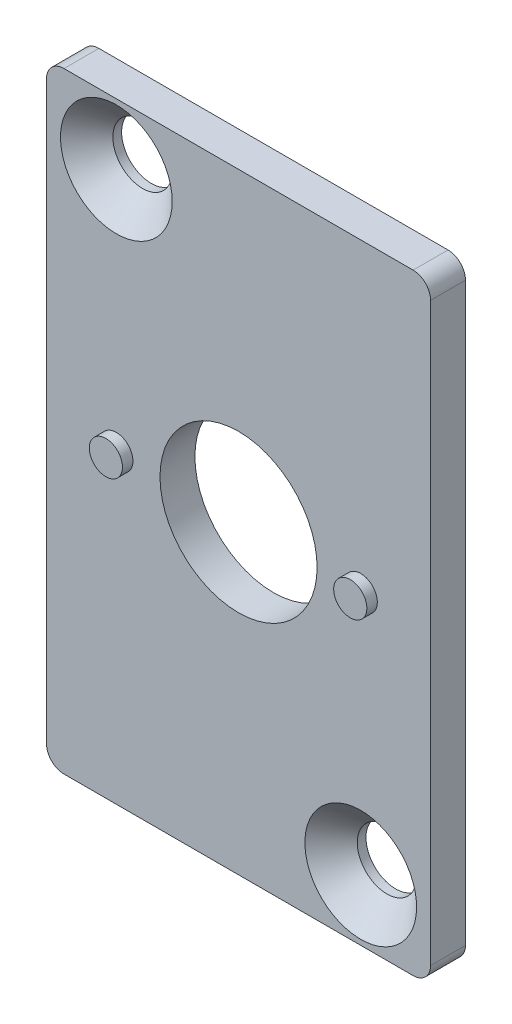
ISO-10303-21;
HEADER;
FILE_DESCRIPTION(('STEP AP214'),'2;1');
FILE_NAME('part.step','',(''),(''),'','','');
FILE_SCHEMA(('AUTOMOTIVE_DESIGN { 1 0 10303 214 1 1 1 1 }'));
ENDSEC;
DATA;
#1=APPLICATION_CONTEXT('core data for automotive mechanical design processes');
#2=APPLICATION_PROTOCOL_DEFINITION('international standard','automotive_design',2000,#1);
#3=PRODUCT_CONTEXT('',#1,'mechanical');
#4=PRODUCT('Part','Part','',(#3));
#5=PRODUCT_RELATED_PRODUCT_CATEGORY('part','',(#4));
#6=PRODUCT_DEFINITION_FORMATION('','',#4);
#7=PRODUCT_DEFINITION_CONTEXT('part definition',#1,'design');
#8=PRODUCT_DEFINITION('design','',#6,#7);
#9=PRODUCT_DEFINITION_SHAPE('','',#8);
#10=(LENGTH_UNIT() NAMED_UNIT(*) SI_UNIT(.MILLI.,.METRE.));
#11=(NAMED_UNIT(*) PLANE_ANGLE_UNIT() SI_UNIT($,.RADIAN.));
#12=(NAMED_UNIT(*) SI_UNIT($,.STERADIAN.) SOLID_ANGLE_UNIT());
#13=UNCERTAINTY_MEASURE_WITH_UNIT(LENGTH_MEASURE(1.E-05),#10,'distance_accuracy_value','');
#14=(GEOMETRIC_REPRESENTATION_CONTEXT(3) GLOBAL_UNCERTAINTY_ASSIGNED_CONTEXT((#13)) GLOBAL_UNIT_ASSIGNED_CONTEXT((#10,
#11,#12)) REPRESENTATION_CONTEXT('',''));
#15=CARTESIAN_POINT('',(0.,0.,0.));
#16=DIRECTION('',(0.,0.,1.));
#17=DIRECTION('',(1.,0.,0.));
#18=AXIS2_PLACEMENT_3D('',#15,#16,#17);
#19=CARTESIAN_POINT('',(-12.8609204169845,0.950419527078566,68.6));
#20=DIRECTION('',(0.,0.,1.));
#21=DIRECTION('',(1.,0.,0.));
#22=AXIS2_PLACEMENT_3D('',#19,#20,#21);
#23=PLANE('',#22);
#24=CARTESIAN_POINT('',(-12.8609204169845,0.950419527078566,68.6));
#25=DIRECTION('',(0.,0.,1.));
#26=DIRECTION('',(1.,0.,0.));
#27=AXIS2_PLACEMENT_3D('',#24,#25,#26);
#28=CIRCLE('',#27,0.95);
#29=CARTESIAN_POINT('',(-11.9109204169845,0.950419527078566,68.6));
#30=VERTEX_POINT('',#29);
#31=EDGE_CURVE('E21',#30,#30,#28,.F.);
#32=ORIENTED_EDGE('',*,*,#31,.F.);
#33=EDGE_LOOP('',(#32));
#34=FACE_BOUND('',#33,.T.);
#35=ADVANCED_FACE('F18',(#34),#23,.T.);
#36=CARTESIAN_POINT('',(1.13907958301551,0.950419527078566,68.6));
#37=DIRECTION('',(0.,0.,1.));
#38=DIRECTION('',(1.,0.,0.));
#39=AXIS2_PLACEMENT_3D('',#36,#37,#38);
#40=PLANE('',#39);
#41=CARTESIAN_POINT('',(1.13907958301551,0.950419527078566,68.6));
#42=DIRECTION('',(0.,0.,1.));
#43=DIRECTION('',(1.,0.,0.));
#44=AXIS2_PLACEMENT_3D('',#41,#42,#43);
#45=CIRCLE('',#44,0.95);
#46=CARTESIAN_POINT('',(2.08907958301551,0.950419527078566,68.6));
#47=VERTEX_POINT('',#46);
#48=EDGE_CURVE('E71',#47,#47,#45,.F.);
#49=ORIENTED_EDGE('',*,*,#48,.F.);
#50=EDGE_LOOP('',(#49));
#51=FACE_BOUND('',#50,.T.);
#52=ADVANCED_FACE('F172',(#51),#40,.T.);
#53=CARTESIAN_POINT('',(-12.8609204169845,0.950419527078566,68.6));
#54=DIRECTION('',(0.,0.,1.));
#55=DIRECTION('',(1.,0.,0.));
#56=AXIS2_PLACEMENT_3D('',#53,#54,#55);
#57=CYLINDRICAL_SURFACE('',#56,0.95);
#58=CARTESIAN_POINT('',(-12.8609204169845,0.950419527078566,68.));
#59=DIRECTION('',(0.,0.,1.));
#60=DIRECTION('',(1.,0.,0.));
#61=AXIS2_PLACEMENT_3D('',#58,#59,#60);
#62=CIRCLE('',#61,0.95);
#63=CARTESIAN_POINT('',(-11.9109204169845,0.950419527078566,68.));
#64=VERTEX_POINT('',#63);
#65=EDGE_CURVE('E145',#64,#64,#62,.F.);
#66=ORIENTED_EDGE('',*,*,#65,.F.);
#67=EDGE_LOOP('',(#66));
#68=FACE_BOUND('',#67,.T.);
#69=ORIENTED_EDGE('',*,*,#31,.T.);
#70=EDGE_LOOP('',(#69));
#71=FACE_BOUND('',#70,.T.);
#72=ADVANCED_FACE('F169',(#68,#71),#57,.T.);
#73=CARTESIAN_POINT('',(1.13907958301551,0.950419527078566,68.6));
#74=DIRECTION('',(0.,0.,1.));
#75=DIRECTION('',(1.,0.,0.));
#76=AXIS2_PLACEMENT_3D('',#73,#74,#75);
#77=CYLINDRICAL_SURFACE('',#76,0.95);
#78=CARTESIAN_POINT('',(1.13907958301551,0.950419527078566,68.));
#79=DIRECTION('',(0.,0.,1.));
#80=DIRECTION('',(1.,0.,0.));
#81=AXIS2_PLACEMENT_3D('',#78,#79,#80);
#82=CIRCLE('',#81,0.95);
#83=CARTESIAN_POINT('',(2.08907958301551,0.950419527078566,68.));
#84=VERTEX_POINT('',#83);
#85=EDGE_CURVE('E142',#84,#84,#82,.F.);
#86=ORIENTED_EDGE('',*,*,#85,.F.);
#87=EDGE_LOOP('',(#86));
#88=FACE_BOUND('',#87,.T.);
#89=ORIENTED_EDGE('',*,*,#48,.T.);
#90=EDGE_LOOP('',(#89));
#91=FACE_BOUND('',#90,.T.);
#92=ADVANCED_FACE('F237',(#88,#91),#77,.T.);
#93=CARTESIAN_POINT('',(4.13907958301551,17.4504195270786,68.));
#94=DIRECTION('',(0.,0.,1.));
#95=DIRECTION('',(1.,0.,0.));
#96=AXIS2_PLACEMENT_3D('',#93,#94,#95);
#97=CYLINDRICAL_SURFACE('',#96,1.);
#98=CARTESIAN_POINT('',(4.13907958301551,17.4504195270786,68.));
#99=DIRECTION('',(0.,0.,1.));
#100=DIRECTION('',(1.,0.,0.));
#101=AXIS2_PLACEMENT_3D('',#98,#99,#100);
#102=CIRCLE('',#101,1.);
#103=CARTESIAN_POINT('',(5.13907958301551,17.4504195270786,68.));
#104=VERTEX_POINT('',#103);
#105=CARTESIAN_POINT('',(4.13907958301551,18.4504195270786,68.));
#106=VERTEX_POINT('',#105);
#107=EDGE_CURVE('E151',#104,#106,#102,.T.);
#108=ORIENTED_EDGE('',*,*,#107,.F.);
#109=DIRECTION('',(0.,0.,-1.));
#110=VECTOR('',#109,1.);
#111=CARTESIAN_POINT('',(5.13907958301551,17.4504195270786,68.));
#112=LINE('',#111,#110);
#113=CARTESIAN_POINT('',(5.13907958301551,17.4504195270786,66.));
#114=VERTEX_POINT('',#113);
#115=EDGE_CURVE('E68',#114,#104,#112,.F.);
#116=ORIENTED_EDGE('',*,*,#115,.F.);
#117=CARTESIAN_POINT('',(4.13907958301551,17.4504195270786,66.));
#118=DIRECTION('',(0.,0.,1.));
#119=DIRECTION('',(1.,0.,0.));
#120=AXIS2_PLACEMENT_3D('',#117,#118,#119);
#121=CIRCLE('',#120,1.);
#122=CARTESIAN_POINT('',(4.13907958301551,18.4504195270786,66.));
#123=VERTEX_POINT('',#122);
#124=EDGE_CURVE('E58',#114,#123,#121,.T.);
#125=ORIENTED_EDGE('',*,*,#124,.T.);
#126=DIRECTION('',(0.,0.,1.));
#127=VECTOR('',#126,1.);
#128=CARTESIAN_POINT('',(4.13907958301551,18.4504195270786,68.));
#129=LINE('',#128,#127);
#130=EDGE_CURVE('E66',#106,#123,#129,.F.);
#131=ORIENTED_EDGE('',*,*,#130,.F.);
#132=EDGE_LOOP('',(#108,#116,#125,#131));
#133=FACE_BOUND('',#132,.T.);
#134=ADVANCED_FACE('F64',(#133),#97,.T.);
#135=CARTESIAN_POINT('',(-15.8609204169845,17.4504195270786,68.));
#136=DIRECTION('',(0.,0.,1.));
#137=DIRECTION('',(1.,0.,0.));
#138=AXIS2_PLACEMENT_3D('',#135,#136,#137);
#139=CYLINDRICAL_SURFACE('',#138,1.);
#140=CARTESIAN_POINT('',(-15.8609204169845,17.4504195270786,68.));
#141=DIRECTION('',(0.,0.,1.));
#142=DIRECTION('',(1.,0.,0.));
#143=AXIS2_PLACEMENT_3D('',#140,#141,#142);
#144=CIRCLE('',#143,1.);
#145=CARTESIAN_POINT('',(-15.8609204169845,18.4504195270786,68.));
#146=VERTEX_POINT('',#145);
#147=CARTESIAN_POINT('',(-16.8609204169845,17.4504195270786,68.));
#148=VERTEX_POINT('',#147);
#149=EDGE_CURVE('E148',#146,#148,#144,.T.);
#150=ORIENTED_EDGE('',*,*,#149,.F.);
#151=DIRECTION('',(0.,0.,1.));
#152=VECTOR('',#151,1.);
#153=CARTESIAN_POINT('',(-15.8609204169845,18.4504195270786,68.));
#154=LINE('',#153,#152);
#155=CARTESIAN_POINT('',(-15.8609204169845,18.4504195270786,66.));
#156=VERTEX_POINT('',#155);
#157=EDGE_CURVE('E110',#156,#146,#154,.T.);
#158=ORIENTED_EDGE('',*,*,#157,.F.);
#159=CARTESIAN_POINT('',(-15.8609204169845,17.4504195270786,66.));
#160=DIRECTION('',(0.,0.,1.));
#161=DIRECTION('',(1.,0.,0.));
#162=AXIS2_PLACEMENT_3D('',#159,#160,#161);
#163=CIRCLE('',#162,1.);
#164=CARTESIAN_POINT('',(-16.8609204169845,17.4504195270786,66.));
#165=VERTEX_POINT('',#164);
#166=EDGE_CURVE('E70',#156,#165,#163,.T.);
#167=ORIENTED_EDGE('',*,*,#166,.T.);
#168=DIRECTION('',(0.,0.,1.));
#169=VECTOR('',#168,1.);
#170=CARTESIAN_POINT('',(-16.8609204169845,17.4504195270786,68.));
#171=LINE('',#170,#169);
#172=EDGE_CURVE('E104',#148,#165,#171,.F.);
#173=ORIENTED_EDGE('',*,*,#172,.F.);
#174=EDGE_LOOP('',(#150,#158,#167,#173));
#175=FACE_BOUND('',#174,.T.);
#176=ADVANCED_FACE('F230',(#175),#139,.T.);
#177=CARTESIAN_POINT('',(-15.8609204169845,-15.5495804729214,68.));
#178=DIRECTION('',(0.,0.,1.));
#179=DIRECTION('',(1.,0.,0.));
#180=AXIS2_PLACEMENT_3D('',#177,#178,#179);
#181=CYLINDRICAL_SURFACE('',#180,1.);
#182=CARTESIAN_POINT('',(-15.8609204169845,-15.5495804729214,68.));
#183=DIRECTION('',(0.,0.,1.));
#184=DIRECTION('',(1.,0.,0.));
#185=AXIS2_PLACEMENT_3D('',#182,#183,#184);
#186=CIRCLE('',#185,1.);
#187=CARTESIAN_POINT('',(-16.8609204169845,-15.5495804729214,68.));
#188=VERTEX_POINT('',#187);
#189=CARTESIAN_POINT('',(-15.8609204169845,-16.5495804729214,68.));
#190=VERTEX_POINT('',#189);
#191=EDGE_CURVE('E157',#188,#190,#186,.T.);
#192=ORIENTED_EDGE('',*,*,#191,.F.);
#193=DIRECTION('',(0.,0.,1.));
#194=VECTOR('',#193,1.);
#195=CARTESIAN_POINT('',(-16.8609204169845,-15.5495804729214,68.));
#196=LINE('',#195,#194);
#197=CARTESIAN_POINT('',(-16.8609204169845,-15.5495804729214,66.));
#198=VERTEX_POINT('',#197);
#199=EDGE_CURVE('E107',#198,#188,#196,.T.);
#200=ORIENTED_EDGE('',*,*,#199,.F.);
#201=CARTESIAN_POINT('',(-15.8609204169845,-15.5495804729214,66.));
#202=DIRECTION('',(0.,0.,1.));
#203=DIRECTION('',(1.,0.,0.));
#204=AXIS2_PLACEMENT_3D('',#201,#202,#203);
#205=CIRCLE('',#204,1.);
#206=CARTESIAN_POINT('',(-15.8609204169845,-16.5495804729214,66.));
#207=VERTEX_POINT('',#206);
#208=EDGE_CURVE('E161',#198,#207,#205,.T.);
#209=ORIENTED_EDGE('',*,*,#208,.T.);
#210=DIRECTION('',(0.,0.,1.));
#211=VECTOR('',#210,1.);
#212=CARTESIAN_POINT('',(-15.8609204169845,-16.5495804729214,68.));
#213=LINE('',#212,#211);
#214=EDGE_CURVE('E96',#190,#207,#213,.F.);
#215=ORIENTED_EDGE('',*,*,#214,.F.);
#216=EDGE_LOOP('',(#192,#200,#209,#215));
#217=FACE_BOUND('',#216,.T.);
#218=ADVANCED_FACE('F226',(#217),#181,.T.);
#219=CARTESIAN_POINT('',(4.13907958301551,-15.5495804729214,68.));
#220=DIRECTION('',(0.,0.,1.));
#221=DIRECTION('',(1.,0.,0.));
#222=AXIS2_PLACEMENT_3D('',#219,#220,#221);
#223=CYLINDRICAL_SURFACE('',#222,1.);
#224=CARTESIAN_POINT('',(4.13907958301551,-15.5495804729214,68.));
#225=DIRECTION('',(0.,0.,1.));
#226=DIRECTION('',(1.,0.,0.));
#227=AXIS2_PLACEMENT_3D('',#224,#225,#226);
#228=CIRCLE('',#227,1.);
#229=CARTESIAN_POINT('',(4.13907958301551,-16.5495804729214,68.));
#230=VERTEX_POINT('',#229);
#231=CARTESIAN_POINT('',(5.13907958301551,-15.5495804729214,68.));
#232=VERTEX_POINT('',#231);
#233=EDGE_CURVE('E154',#230,#232,#228,.T.);
#234=ORIENTED_EDGE('',*,*,#233,.F.);
#235=DIRECTION('',(0.,0.,1.));
#236=VECTOR('',#235,1.);
#237=CARTESIAN_POINT('',(4.13907958301551,-16.5495804729214,68.));
#238=LINE('',#237,#236);
#239=CARTESIAN_POINT('',(4.13907958301551,-16.5495804729214,66.));
#240=VERTEX_POINT('',#239);
#241=EDGE_CURVE('E99',#240,#230,#238,.T.);
#242=ORIENTED_EDGE('',*,*,#241,.F.);
#243=CARTESIAN_POINT('',(4.13907958301551,-15.5495804729214,66.));
#244=DIRECTION('',(0.,0.,1.));
#245=DIRECTION('',(1.,0.,0.));
#246=AXIS2_PLACEMENT_3D('',#243,#244,#245);
#247=CIRCLE('',#246,1.);
#248=CARTESIAN_POINT('',(5.13907958301551,-15.5495804729214,66.));
#249=VERTEX_POINT('',#248);
#250=EDGE_CURVE('E36',#240,#249,#247,.T.);
#251=ORIENTED_EDGE('',*,*,#250,.T.);
#252=DIRECTION('',(0.,0.,-1.));
#253=VECTOR('',#252,1.);
#254=CARTESIAN_POINT('',(5.13907958301551,-15.5495804729214,68.));
#255=LINE('',#254,#253);
#256=EDGE_CURVE('E112',#232,#249,#255,.T.);
#257=ORIENTED_EDGE('',*,*,#256,.F.);
#258=EDGE_LOOP('',(#234,#242,#251,#257));
#259=FACE_BOUND('',#258,.T.);
#260=ADVANCED_FACE('F222',(#259),#223,.T.);
#261=CARTESIAN_POINT('',(-5.86092041698449,0.950419527078566,68.));
#262=DIRECTION('',(0.,0.,1.));
#263=DIRECTION('',(1.,0.,0.));
#264=AXIS2_PLACEMENT_3D('',#261,#262,#263);
#265=PLANE('',#264);
#266=ORIENTED_EDGE('',*,*,#85,.T.);
#267=EDGE_LOOP('',(#266));
#268=FACE_BOUND('',#267,.T.);
#269=CARTESIAN_POINT('',(-12.8609204169845,14.9504195270786,68.0000000000405));
#270=DIRECTION('',(0.,0.,1.));
#271=DIRECTION('',(1.,0.,0.));
#272=AXIS2_PLACEMENT_3D('',#269,#270,#271);
#273=CIRCLE('',#272,3.19999999999364);
#274=CARTESIAN_POINT('',(-9.66092041699085,14.9504195270786,68.0000000000405));
#275=VERTEX_POINT('',#274);
#276=EDGE_CURVE('E117',#275,#275,#273,.F.);
#277=ORIENTED_EDGE('',*,*,#276,.T.);
#278=EDGE_LOOP('',(#277));
#279=FACE_BOUND('',#278,.T.);
#280=CARTESIAN_POINT('',(1.13907958301552,-13.0495804729214,67.9999999999836));
#281=DIRECTION('',(0.,0.,1.));
#282=DIRECTION('',(1.,0.,0.));
#283=AXIS2_PLACEMENT_3D('',#280,#281,#282);
#284=CIRCLE('',#283,3.20000000000364);
#285=CARTESIAN_POINT('',(4.33907958301916,-13.0495804729214,67.9999999999836));
#286=VERTEX_POINT('',#285);
#287=EDGE_CURVE('E139',#286,#286,#284,.F.);
#288=ORIENTED_EDGE('',*,*,#287,.T.);
#289=EDGE_LOOP('',(#288));
#290=FACE_BOUND('',#289,.T.);
#291=CARTESIAN_POINT('',(-5.86092041698449,0.950419527078566,68.));
#292=DIRECTION('',(0.,0.,1.));
#293=DIRECTION('',(1.,0.,0.));
#294=AXIS2_PLACEMENT_3D('',#291,#292,#293);
#295=CIRCLE('',#294,4.5);
#296=CARTESIAN_POINT('',(-1.36092041698449,0.950419527078566,68.));
#297=VERTEX_POINT('',#296);
#298=EDGE_CURVE('E103',#297,#297,#295,.F.);
#299=ORIENTED_EDGE('',*,*,#298,.T.);
#300=EDGE_LOOP('',(#299));
#301=FACE_BOUND('',#300,.T.);
#302=ORIENTED_EDGE('',*,*,#65,.T.);
#303=EDGE_LOOP('',(#302));
#304=FACE_BOUND('',#303,.T.);
#305=DIRECTION('',(1.,0.,0.));
#306=VECTOR('',#305,1.);
#307=CARTESIAN_POINT('',(5.13907958301551,18.4504195270786,68.));
#308=LINE('',#307,#306);
#309=EDGE_CURVE('E80',#146,#106,#308,.T.);
#310=ORIENTED_EDGE('',*,*,#309,.F.);
#311=ORIENTED_EDGE('',*,*,#149,.T.);
#312=DIRECTION('',(0.,-1.,0.));
#313=VECTOR('',#312,1.);
#314=CARTESIAN_POINT('',(-16.8609204169845,18.4504195270786,68.));
#315=LINE('',#314,#313);
#316=EDGE_CURVE('E81',#188,#148,#315,.F.);
#317=ORIENTED_EDGE('',*,*,#316,.F.);
#318=ORIENTED_EDGE('',*,*,#191,.T.);
#319=DIRECTION('',(1.,0.,0.));
#320=VECTOR('',#319,1.);
#321=CARTESIAN_POINT('',(-16.8609204169845,-16.5495804729214,68.));
#322=LINE('',#321,#320);
#323=EDGE_CURVE('E100',#230,#190,#322,.F.);
#324=ORIENTED_EDGE('',*,*,#323,.F.);
#325=ORIENTED_EDGE('',*,*,#233,.T.);
#326=DIRECTION('',(0.,1.,0.));
#327=VECTOR('',#326,1.);
#328=CARTESIAN_POINT('',(5.13907958301551,-16.5495804729214,68.));
#329=LINE('',#328,#327);
#330=EDGE_CURVE('E115',#104,#232,#329,.F.);
#331=ORIENTED_EDGE('',*,*,#330,.F.);
#332=ORIENTED_EDGE('',*,*,#107,.T.);
#333=EDGE_LOOP('',(#310,#311,#317,#318,#324,#325,#331,#332));
#334=FACE_BOUND('',#333,.T.);
#335=ADVANCED_FACE('F218',(#268,#279,#290,#301,#304,#334),#265,.T.);
#336=CARTESIAN_POINT('',(1.13907958301552,-13.0495804729214,67.9999999998699));
#337=DIRECTION('',(0.,0.,1.));
#338=DIRECTION('',(1.,0.,0.));
#339=AXIS2_PLACEMENT_3D('',#336,#337,#338);
#340=CONICAL_SURFACE('',#339,3.19999999988995,0.785398163397448);
#341=ORIENTED_EDGE('',*,*,#287,.F.);
#342=EDGE_LOOP('',(#341));
#343=FACE_BOUND('',#342,.T.);
#344=CARTESIAN_POINT('',(1.13907958301552,-13.0495804729214,66.5));
#345=DIRECTION('',(0.,0.,-1.));
#346=DIRECTION('',(-1.,0.,0.));
#347=AXIS2_PLACEMENT_3D('',#344,#345,#346);
#348=CIRCLE('',#347,1.69999999999999);
#349=CARTESIAN_POINT('',(-0.560920416984477,-13.0495804729214,66.5));
#350=VERTEX_POINT('',#349);
#351=EDGE_CURVE('E120',#350,#350,#348,.T.);
#352=ORIENTED_EDGE('',*,*,#351,.T.);
#353=EDGE_LOOP('',(#352));
#354=FACE_BOUND('',#353,.T.);
#355=ADVANCED_FACE('F214',(#343,#354),#340,.F.);
#356=CARTESIAN_POINT('',(-12.8609204169845,14.9504195270786,67.9999999999268));
#357=DIRECTION('',(0.,0.,1.));
#358=DIRECTION('',(1.,0.,0.));
#359=AXIS2_PLACEMENT_3D('',#356,#357,#358);
#360=CONICAL_SURFACE('',#359,3.19999999987996,0.785398163378501);
#361=ORIENTED_EDGE('',*,*,#276,.F.);
#362=EDGE_LOOP('',(#361));
#363=FACE_BOUND('',#362,.T.);
#364=CARTESIAN_POINT('',(-12.8609204169845,14.9504195270786,66.5));
#365=DIRECTION('',(0.,0.,-1.));
#366=DIRECTION('',(-1.,0.,0.));
#367=AXIS2_PLACEMENT_3D('',#364,#365,#366);
#368=CIRCLE('',#367,1.69999999999999);
#369=CARTESIAN_POINT('',(-14.5609204169845,14.9504195270786,66.5));
#370=VERTEX_POINT('',#369);
#371=EDGE_CURVE('E92',#370,#370,#368,.T.);
#372=ORIENTED_EDGE('',*,*,#371,.T.);
#373=EDGE_LOOP('',(#372));
#374=FACE_BOUND('',#373,.T.);
#375=ADVANCED_FACE('F210',(#363,#374),#360,.F.);
#376=CARTESIAN_POINT('',(5.13907958301551,-16.5495804729214,68.));
#377=DIRECTION('',(1.,0.,0.));
#378=DIRECTION('',(0.,0.,-1.));
#379=AXIS2_PLACEMENT_3D('',#376,#377,#378);
#380=PLANE('',#379);
#381=ORIENTED_EDGE('',*,*,#330,.T.);
#382=ORIENTED_EDGE('',*,*,#256,.T.);
#383=DIRECTION('',(0.,1.,0.));
#384=VECTOR('',#383,1.);
#385=CARTESIAN_POINT('',(5.13907958301551,0.950419527078566,66.));
#386=LINE('',#385,#384);
#387=EDGE_CURVE('E87',#249,#114,#386,.T.);
#388=ORIENTED_EDGE('',*,*,#387,.T.);
#389=ORIENTED_EDGE('',*,*,#115,.T.);
#390=EDGE_LOOP('',(#381,#382,#388,#389));
#391=FACE_BOUND('',#390,.T.);
#392=ADVANCED_FACE('F207',(#391),#380,.T.);
#393=CARTESIAN_POINT('',(5.13907958301551,18.4504195270786,68.));
#394=DIRECTION('',(0.,1.,0.));
#395=DIRECTION('',(0.,0.,1.));
#396=AXIS2_PLACEMENT_3D('',#393,#394,#395);
#397=PLANE('',#396);
#398=ORIENTED_EDGE('',*,*,#309,.T.);
#399=ORIENTED_EDGE('',*,*,#130,.T.);
#400=DIRECTION('',(1.,0.,0.));
#401=VECTOR('',#400,1.);
#402=CARTESIAN_POINT('',(-5.86092041698449,18.4504195270786,66.));
#403=LINE('',#402,#401);
#404=EDGE_CURVE('E78',#123,#156,#403,.F.);
#405=ORIENTED_EDGE('',*,*,#404,.T.);
#406=ORIENTED_EDGE('',*,*,#157,.T.);
#407=EDGE_LOOP('',(#398,#399,#405,#406));
#408=FACE_BOUND('',#407,.T.);
#409=ADVANCED_FACE('F76',(#408),#397,.T.);
#410=CARTESIAN_POINT('',(-16.8609204169845,18.4504195270786,68.));
#411=DIRECTION('',(-1.,0.,0.));
#412=DIRECTION('',(0.,-1.,0.));
#413=AXIS2_PLACEMENT_3D('',#410,#411,#412);
#414=PLANE('',#413);
#415=DIRECTION('',(0.,1.,0.));
#416=VECTOR('',#415,1.);
#417=CARTESIAN_POINT('',(-16.8609204169845,0.950419527078566,66.));
#418=LINE('',#417,#416);
#419=EDGE_CURVE('E86',#165,#198,#418,.F.);
#420=ORIENTED_EDGE('',*,*,#419,.T.);
#421=ORIENTED_EDGE('',*,*,#199,.T.);
#422=ORIENTED_EDGE('',*,*,#316,.T.);
#423=ORIENTED_EDGE('',*,*,#172,.T.);
#424=EDGE_LOOP('',(#420,#421,#422,#423));
#425=FACE_BOUND('',#424,.T.);
#426=ADVANCED_FACE('F200',(#425),#414,.T.);
#427=CARTESIAN_POINT('',(-16.8609204169845,-16.5495804729214,68.));
#428=DIRECTION('',(0.,-1.,0.));
#429=DIRECTION('',(1.,0.,0.));
#430=AXIS2_PLACEMENT_3D('',#427,#428,#429);
#431=PLANE('',#430);
#432=DIRECTION('',(1.,0.,0.));
#433=VECTOR('',#432,1.);
#434=CARTESIAN_POINT('',(-5.86092041698449,-16.5495804729214,66.));
#435=LINE('',#434,#433);
#436=EDGE_CURVE('E90',#207,#240,#435,.T.);
#437=ORIENTED_EDGE('',*,*,#436,.T.);
#438=ORIENTED_EDGE('',*,*,#241,.T.);
#439=ORIENTED_EDGE('',*,*,#323,.T.);
#440=ORIENTED_EDGE('',*,*,#214,.T.);
#441=EDGE_LOOP('',(#437,#438,#439,#440));
#442=FACE_BOUND('',#441,.T.);
#443=ADVANCED_FACE('F196',(#442),#431,.T.);
#444=CARTESIAN_POINT('',(-5.86092041698449,0.950419527078566,68.));
#445=DIRECTION('',(0.,0.,1.));
#446=DIRECTION('',(1.,0.,0.));
#447=AXIS2_PLACEMENT_3D('',#444,#445,#446);
#448=CYLINDRICAL_SURFACE('',#447,4.5);
#449=CARTESIAN_POINT('',(-5.86092041698449,0.950419527078566,66.));
#450=DIRECTION('',(0.,0.,1.));
#451=DIRECTION('',(1.,0.,0.));
#452=AXIS2_PLACEMENT_3D('',#449,#450,#451);
#453=CIRCLE('',#452,4.5);
#454=CARTESIAN_POINT('',(-1.36092041698449,0.950419527078566,66.));
#455=VERTEX_POINT('',#454);
#456=EDGE_CURVE('E132',#455,#455,#453,.F.);
#457=ORIENTED_EDGE('',*,*,#456,.T.);
#458=EDGE_LOOP('',(#457));
#459=FACE_BOUND('',#458,.T.);
#460=ORIENTED_EDGE('',*,*,#298,.F.);
#461=EDGE_LOOP('',(#460));
#462=FACE_BOUND('',#461,.T.);
#463=ADVANCED_FACE('F192',(#459,#462),#448,.F.);
#464=CARTESIAN_POINT('',(1.13907958301552,-13.0495804729214,68.));
#465=DIRECTION('',(0.,0.,-1.));
#466=DIRECTION('',(-1.,0.,0.));
#467=AXIS2_PLACEMENT_3D('',#464,#465,#466);
#468=CYLINDRICAL_SURFACE('',#467,1.69999999999999);
#469=ORIENTED_EDGE('',*,*,#351,.F.);
#470=EDGE_LOOP('',(#469));
#471=FACE_BOUND('',#470,.T.);
#472=CARTESIAN_POINT('',(1.13907958301552,-13.0495804729214,66.));
#473=DIRECTION('',(0.,0.,-1.));
#474=DIRECTION('',(-1.,0.,0.));
#475=AXIS2_PLACEMENT_3D('',#472,#473,#474);
#476=CIRCLE('',#475,1.69999999999999);
#477=CARTESIAN_POINT('',(-0.560920416984477,-13.0495804729214,66.));
#478=VERTEX_POINT('',#477);
#479=EDGE_CURVE('E27',#478,#478,#476,.T.);
#480=ORIENTED_EDGE('',*,*,#479,.T.);
#481=EDGE_LOOP('',(#480));
#482=FACE_BOUND('',#481,.T.);
#483=ADVANCED_FACE('F184',(#471,#482),#468,.F.);
#484=CARTESIAN_POINT('',(-12.8609204169845,14.9504195270786,68.));
#485=DIRECTION('',(0.,0.,-1.));
#486=DIRECTION('',(-1.,0.,0.));
#487=AXIS2_PLACEMENT_3D('',#484,#485,#486);
#488=CYLINDRICAL_SURFACE('',#487,1.69999999999999);
#489=ORIENTED_EDGE('',*,*,#371,.F.);
#490=EDGE_LOOP('',(#489));
#491=FACE_BOUND('',#490,.T.);
#492=CARTESIAN_POINT('',(-12.8609204169845,14.9504195270786,66.));
#493=DIRECTION('',(0.,0.,-1.));
#494=DIRECTION('',(-1.,0.,0.));
#495=AXIS2_PLACEMENT_3D('',#492,#493,#494);
#496=CIRCLE('',#495,1.69999999999999);
#497=CARTESIAN_POINT('',(-14.5609204169845,14.9504195270786,66.));
#498=VERTEX_POINT('',#497);
#499=EDGE_CURVE('E11',#498,#498,#496,.T.);
#500=ORIENTED_EDGE('',*,*,#499,.T.);
#501=EDGE_LOOP('',(#500));
#502=FACE_BOUND('',#501,.T.);
#503=ADVANCED_FACE('F179',(#491,#502),#488,.F.);
#504=CARTESIAN_POINT('',(-5.86092041698449,0.950419527078566,66.));
#505=DIRECTION('',(0.,0.,1.));
#506=DIRECTION('',(1.,0.,0.));
#507=AXIS2_PLACEMENT_3D('',#504,#505,#506);
#508=PLANE('',#507);
#509=ORIENTED_EDGE('',*,*,#499,.F.);
#510=EDGE_LOOP('',(#509));
#511=FACE_BOUND('',#510,.T.);
#512=ORIENTED_EDGE('',*,*,#479,.F.);
#513=EDGE_LOOP('',(#512));
#514=FACE_BOUND('',#513,.T.);
#515=ORIENTED_EDGE('',*,*,#456,.F.);
#516=EDGE_LOOP('',(#515));
#517=FACE_BOUND('',#516,.T.);
#518=ORIENTED_EDGE('',*,*,#436,.F.);
#519=ORIENTED_EDGE('',*,*,#208,.F.);
#520=ORIENTED_EDGE('',*,*,#419,.F.);
#521=ORIENTED_EDGE('',*,*,#166,.F.);
#522=ORIENTED_EDGE('',*,*,#404,.F.);
#523=ORIENTED_EDGE('',*,*,#124,.F.);
#524=ORIENTED_EDGE('',*,*,#387,.F.);
#525=ORIENTED_EDGE('',*,*,#250,.F.);
#526=EDGE_LOOP('',(#518,#519,#520,#521,#522,#523,#524,#525));
#527=FACE_BOUND('',#526,.T.);
#528=ADVANCED_FACE('F83',(#511,#514,#517,#527),#508,.F.);
#529=CLOSED_SHELL('',(#35,#52,#72,#92,#134,#176,#218,#260,#335,#355,#375,#392,#409,#426,#443,
#463,#483,#503,#528));
#530=MANIFOLD_SOLID_BREP('B1',#529);
#531=ADVANCED_BREP_SHAPE_REPRESENTATION('',(#18,#530),#14);
#532=SHAPE_DEFINITION_REPRESENTATION(#9,#531);
ENDSEC;
END-ISO-10303-21;
